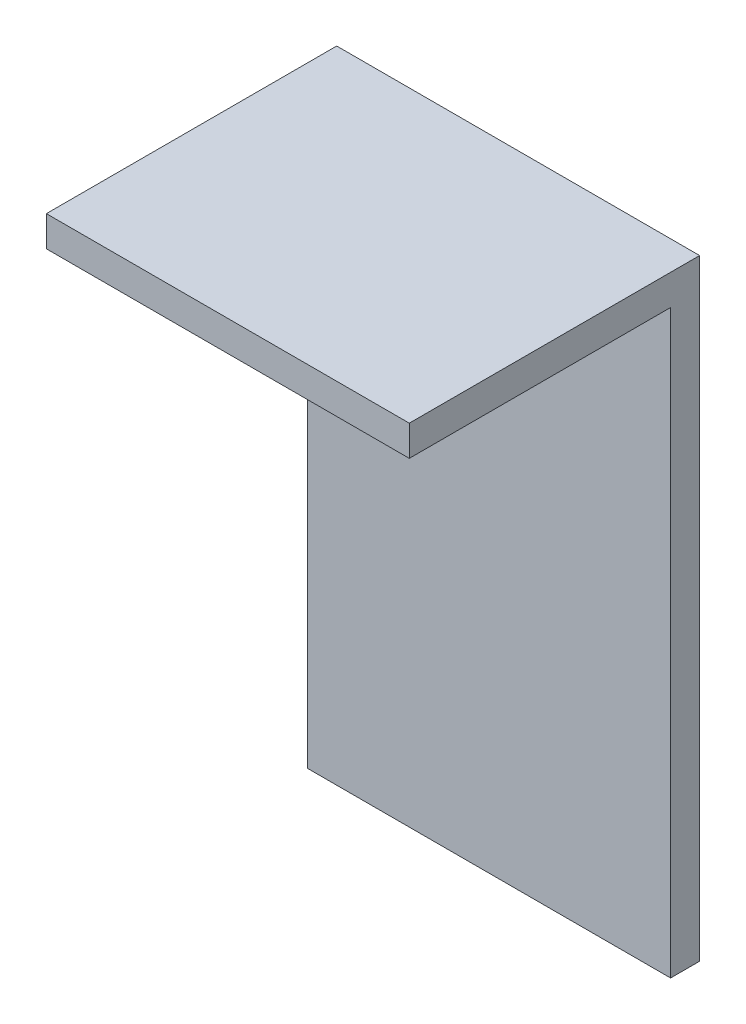
ISO-10303-21;
HEADER;
FILE_DESCRIPTION(('STEP AP214'),'2;1');
FILE_NAME('part.step','',(''),(''),'','','');
FILE_SCHEMA(('AUTOMOTIVE_DESIGN { 1 0 10303 214 1 1 1 1 }'));
ENDSEC;
DATA;
#1=APPLICATION_CONTEXT('core data for automotive mechanical design processes');
#2=APPLICATION_PROTOCOL_DEFINITION('international standard','automotive_design',2000,#1);
#3=PRODUCT_CONTEXT('',#1,'mechanical');
#4=PRODUCT('Part','Part','',(#3));
#5=PRODUCT_RELATED_PRODUCT_CATEGORY('part','',(#4));
#6=PRODUCT_DEFINITION_FORMATION('','',#4);
#7=PRODUCT_DEFINITION_CONTEXT('part definition',#1,'design');
#8=PRODUCT_DEFINITION('design','',#6,#7);
#9=PRODUCT_DEFINITION_SHAPE('','',#8);
#10=(LENGTH_UNIT() NAMED_UNIT(*) SI_UNIT(.MILLI.,.METRE.));
#11=(NAMED_UNIT(*) PLANE_ANGLE_UNIT() SI_UNIT($,.RADIAN.));
#12=(NAMED_UNIT(*) SI_UNIT($,.STERADIAN.) SOLID_ANGLE_UNIT());
#13=UNCERTAINTY_MEASURE_WITH_UNIT(LENGTH_MEASURE(1.E-05),#10,'distance_accuracy_value','');
#14=(GEOMETRIC_REPRESENTATION_CONTEXT(3) GLOBAL_UNCERTAINTY_ASSIGNED_CONTEXT((#13)) GLOBAL_UNIT_ASSIGNED_CONTEXT((#10,
#11,#12)) REPRESENTATION_CONTEXT('',''));
#15=CARTESIAN_POINT('',(0.,0.,0.));
#16=DIRECTION('',(0.,0.,1.));
#17=DIRECTION('',(1.,0.,0.));
#18=AXIS2_PLACEMENT_3D('',#15,#16,#17);
#19=CARTESIAN_POINT('',(-0.27832069959544,1.5105,0.2));
#20=DIRECTION('',(0.,0.,1.));
#21=DIRECTION('',(0.,-1.,0.));
#22=AXIS2_PLACEMENT_3D('',#19,#20,#21);
#23=PLANE('',#22);
#24=DIRECTION('',(1.,0.,0.));
#25=VECTOR('',#24,1.);
#26=CARTESIAN_POINT('',(-0.27832069959544,1.521,0.2));
#27=LINE('',#26,#25);
#28=CARTESIAN_POINT('',(-0.403320699595441,1.521,0.2));
#29=VERTEX_POINT('',#28);
#30=CARTESIAN_POINT('',(-0.153320699595441,1.521,0.2));
#31=VERTEX_POINT('',#30);
#32=EDGE_CURVE('E75',#29,#31,#27,.T.);
#33=ORIENTED_EDGE('',*,*,#32,.F.);
#34=DIRECTION('',(0.,-1.,0.));
#35=VECTOR('',#34,1.);
#36=CARTESIAN_POINT('',(-0.403320699595441,1.36847101449275,0.2));
#37=LINE('',#36,#35);
#38=CARTESIAN_POINT('',(-0.403320699595441,1.5,0.2));
#39=VERTEX_POINT('',#38);
#40=EDGE_CURVE('E97',#29,#39,#37,.T.);
#41=ORIENTED_EDGE('',*,*,#40,.T.);
#42=DIRECTION('',(1.,0.,0.));
#43=VECTOR('',#42,1.);
#44=CARTESIAN_POINT('',(-0.27832069959544,1.5,0.2));
#45=LINE('',#44,#43);
#46=CARTESIAN_POINT('',(-0.153320699595441,1.5,0.2));
#47=VERTEX_POINT('',#46);
#48=EDGE_CURVE('E11',#39,#47,#45,.T.);
#49=ORIENTED_EDGE('',*,*,#48,.T.);
#50=DIRECTION('',(0.,-1.,0.));
#51=VECTOR('',#50,1.);
#52=CARTESIAN_POINT('',(-0.15332069959544,1.36847101449275,0.2));
#53=LINE('',#52,#51);
#54=EDGE_CURVE('E94',#31,#47,#53,.T.);
#55=ORIENTED_EDGE('',*,*,#54,.F.);
#56=EDGE_LOOP('',(#33,#41,#49,#55));
#57=FACE_BOUND('',#56,.T.);
#58=ADVANCED_FACE('F17',(#57),#23,.T.);
#59=CARTESIAN_POINT('',(-0.27832069959544,1.5,0.11));
#60=DIRECTION('',(0.,1.,0.));
#61=DIRECTION('',(1.,0.,0.));
#62=AXIS2_PLACEMENT_3D('',#59,#60,#61);
#63=PLANE('',#62);
#64=DIRECTION('',(0.,0.,-1.));
#65=VECTOR('',#64,1.);
#66=CARTESIAN_POINT('',(-0.403320699595441,1.5,0.0420289855072457));
#67=LINE('',#66,#65);
#68=CARTESIAN_POINT('',(-0.403320699595441,1.5,0.02));
#69=VERTEX_POINT('',#68);
#70=EDGE_CURVE('E128',#39,#69,#67,.T.);
#71=ORIENTED_EDGE('',*,*,#70,.T.);
#72=DIRECTION('',(-1.,0.,0.));
#73=VECTOR('',#72,1.);
#74=CARTESIAN_POINT('',(-0.27832069959544,1.5,0.02));
#75=LINE('',#74,#73);
#76=CARTESIAN_POINT('',(-0.15332069959544,1.5,0.02));
#77=VERTEX_POINT('',#76);
#78=EDGE_CURVE('E27',#77,#69,#75,.T.);
#79=ORIENTED_EDGE('',*,*,#78,.F.);
#80=DIRECTION('',(0.,0.,-1.));
#81=VECTOR('',#80,1.);
#82=CARTESIAN_POINT('',(-0.153320699595441,1.5,0.0420289855072457));
#83=LINE('',#82,#81);
#84=EDGE_CURVE('E100',#47,#77,#83,.T.);
#85=ORIENTED_EDGE('',*,*,#84,.F.);
#86=ORIENTED_EDGE('',*,*,#48,.F.);
#87=EDGE_LOOP('',(#71,#79,#85,#86));
#88=FACE_BOUND('',#87,.T.);
#89=ADVANCED_FACE('F101',(#88),#63,.F.);
#90=CARTESIAN_POINT('',(-0.27832069959544,1.3,0.02));
#91=DIRECTION('',(0.,0.,1.));
#92=DIRECTION('',(0.,-1.,0.));
#93=AXIS2_PLACEMENT_3D('',#90,#91,#92);
#94=PLANE('',#93);
#95=DIRECTION('',(0.,-1.,0.));
#96=VECTOR('',#95,1.);
#97=CARTESIAN_POINT('',(-0.403320699595441,1.36847101449275,0.02));
#98=LINE('',#97,#96);
#99=CARTESIAN_POINT('',(-0.40332069959544,1.1,0.02));
#100=VERTEX_POINT('',#99);
#101=EDGE_CURVE('E131',#69,#100,#98,.T.);
#102=ORIENTED_EDGE('',*,*,#101,.T.);
#103=DIRECTION('',(1.,0.,0.));
#104=VECTOR('',#103,1.);
#105=CARTESIAN_POINT('',(-0.27832069959544,1.1,0.02));
#106=LINE('',#105,#104);
#107=CARTESIAN_POINT('',(-0.153320699595439,1.1,0.02));
#108=VERTEX_POINT('',#107);
#109=EDGE_CURVE('E41',#100,#108,#106,.T.);
#110=ORIENTED_EDGE('',*,*,#109,.T.);
#111=DIRECTION('',(0.,-1.,0.));
#112=VECTOR('',#111,1.);
#113=CARTESIAN_POINT('',(-0.15332069959544,1.36847101449275,0.02));
#114=LINE('',#113,#112);
#115=EDGE_CURVE('E105',#77,#108,#114,.T.);
#116=ORIENTED_EDGE('',*,*,#115,.F.);
#117=ORIENTED_EDGE('',*,*,#78,.T.);
#118=EDGE_LOOP('',(#102,#110,#116,#117));
#119=FACE_BOUND('',#118,.T.);
#120=ADVANCED_FACE('F19',(#119),#94,.T.);
#121=CARTESIAN_POINT('',(-0.27832069959544,1.1,0.01));
#122=DIRECTION('',(0.,1.,0.));
#123=DIRECTION('',(1.,0.,0.));
#124=AXIS2_PLACEMENT_3D('',#121,#122,#123);
#125=PLANE('',#124);
#126=DIRECTION('',(0.,0.,-1.));
#127=VECTOR('',#126,1.);
#128=CARTESIAN_POINT('',(-0.153320699595439,1.1,0.0420289855072457));
#129=LINE('',#128,#127);
#130=CARTESIAN_POINT('',(-0.153320699595439,1.1,0.));
#131=VERTEX_POINT('',#130);
#132=EDGE_CURVE('E118',#108,#131,#129,.T.);
#133=ORIENTED_EDGE('',*,*,#132,.F.);
#134=ORIENTED_EDGE('',*,*,#109,.F.);
#135=DIRECTION('',(0.,0.,-1.));
#136=VECTOR('',#135,1.);
#137=CARTESIAN_POINT('',(-0.40332069959544,1.1,0.0420289855072457));
#138=LINE('',#137,#136);
#139=CARTESIAN_POINT('',(-0.40332069959544,1.1,0.));
#140=VERTEX_POINT('',#139);
#141=EDGE_CURVE('E123',#100,#140,#138,.T.);
#142=ORIENTED_EDGE('',*,*,#141,.T.);
#143=DIRECTION('',(1.,0.,0.));
#144=VECTOR('',#143,1.);
#145=CARTESIAN_POINT('',(-0.27832069959544,1.1,0.));
#146=LINE('',#145,#144);
#147=EDGE_CURVE('E138',#140,#131,#146,.T.);
#148=ORIENTED_EDGE('',*,*,#147,.T.);
#149=EDGE_LOOP('',(#133,#134,#142,#148));
#150=FACE_BOUND('',#149,.T.);
#151=ADVANCED_FACE('F172',(#150),#125,.F.);
#152=CARTESIAN_POINT('',(-0.15332069959544,1.36847101449275,0.0420289855072457));
#153=DIRECTION('',(1.,0.,0.));
#154=DIRECTION('',(0.,1.,0.));
#155=AXIS2_PLACEMENT_3D('',#152,#153,#154);
#156=PLANE('',#155);
#157=DIRECTION('',(0.,0.,-1.));
#158=VECTOR('',#157,1.);
#159=CARTESIAN_POINT('',(-0.153320699595441,1.521,0.0999999999999988));
#160=LINE('',#159,#158);
#161=CARTESIAN_POINT('',(-0.153320699595441,1.521,0.));
#162=VERTEX_POINT('',#161);
#163=EDGE_CURVE('E109',#31,#162,#160,.T.);
#164=ORIENTED_EDGE('',*,*,#163,.F.);
#165=ORIENTED_EDGE('',*,*,#54,.T.);
#166=ORIENTED_EDGE('',*,*,#84,.T.);
#167=ORIENTED_EDGE('',*,*,#115,.T.);
#168=ORIENTED_EDGE('',*,*,#132,.T.);
#169=DIRECTION('',(0.,1.,0.));
#170=VECTOR('',#169,1.);
#171=CARTESIAN_POINT('',(-0.153320699595439,1.3105,0.));
#172=LINE('',#171,#170);
#173=EDGE_CURVE('E146',#131,#162,#172,.T.);
#174=ORIENTED_EDGE('',*,*,#173,.T.);
#175=EDGE_LOOP('',(#164,#165,#166,#167,#168,#174));
#176=FACE_BOUND('',#175,.T.);
#177=ADVANCED_FACE('F107',(#176),#156,.T.);
#178=CARTESIAN_POINT('',(-0.27832069959544,1.521,0.0999999999999988));
#179=DIRECTION('',(0.,1.,0.));
#180=DIRECTION('',(1.,0.,0.));
#181=AXIS2_PLACEMENT_3D('',#178,#179,#180);
#182=PLANE('',#181);
#183=ORIENTED_EDGE('',*,*,#32,.T.);
#184=ORIENTED_EDGE('',*,*,#163,.T.);
#185=DIRECTION('',(-1.,0.,0.));
#186=VECTOR('',#185,1.);
#187=CARTESIAN_POINT('',(-0.27832069959544,1.521,0.));
#188=LINE('',#187,#186);
#189=CARTESIAN_POINT('',(-0.403320699595441,1.521,0.));
#190=VERTEX_POINT('',#189);
#191=EDGE_CURVE('E153',#162,#190,#188,.T.);
#192=ORIENTED_EDGE('',*,*,#191,.T.);
#193=DIRECTION('',(0.,0.,1.));
#194=VECTOR('',#193,1.);
#195=CARTESIAN_POINT('',(-0.403320699595441,1.521,0.0420289855072457));
#196=LINE('',#195,#194);
#197=EDGE_CURVE('E127',#190,#29,#196,.T.);
#198=ORIENTED_EDGE('',*,*,#197,.T.);
#199=EDGE_LOOP('',(#183,#184,#192,#198));
#200=FACE_BOUND('',#199,.T.);
#201=ADVANCED_FACE('F160',(#200),#182,.T.);
#202=CARTESIAN_POINT('',(-0.403320699595441,1.36847101449275,0.0420289855072457));
#203=DIRECTION('',(1.,0.,0.));
#204=DIRECTION('',(0.,1.,0.));
#205=AXIS2_PLACEMENT_3D('',#202,#203,#204);
#206=PLANE('',#205);
#207=ORIENTED_EDGE('',*,*,#101,.F.);
#208=ORIENTED_EDGE('',*,*,#70,.F.);
#209=ORIENTED_EDGE('',*,*,#40,.F.);
#210=ORIENTED_EDGE('',*,*,#197,.F.);
#211=DIRECTION('',(0.,-1.,0.));
#212=VECTOR('',#211,1.);
#213=CARTESIAN_POINT('',(-0.403320699595441,1.3105,0.));
#214=LINE('',#213,#212);
#215=EDGE_CURVE('E134',#190,#140,#214,.T.);
#216=ORIENTED_EDGE('',*,*,#215,.T.);
#217=ORIENTED_EDGE('',*,*,#141,.F.);
#218=EDGE_LOOP('',(#207,#208,#209,#210,#216,#217));
#219=FACE_BOUND('',#218,.T.);
#220=ADVANCED_FACE('F170',(#219),#206,.F.);
#221=CARTESIAN_POINT('',(-0.27832069959544,1.3105,0.));
#222=DIRECTION('',(0.,0.,1.));
#223=DIRECTION('',(0.,-1.,0.));
#224=AXIS2_PLACEMENT_3D('',#221,#222,#223);
#225=PLANE('',#224);
#226=ORIENTED_EDGE('',*,*,#191,.F.);
#227=ORIENTED_EDGE('',*,*,#173,.F.);
#228=ORIENTED_EDGE('',*,*,#147,.F.);
#229=ORIENTED_EDGE('',*,*,#215,.F.);
#230=EDGE_LOOP('',(#226,#227,#228,#229));
#231=FACE_BOUND('',#230,.T.);
#232=ADVANCED_FACE('F165',(#231),#225,.F.);
#233=CLOSED_SHELL('',(#58,#89,#120,#151,#177,#201,#220,#232));
#234=MANIFOLD_SOLID_BREP('B1',#233);
#235=ADVANCED_BREP_SHAPE_REPRESENTATION('',(#18,#234),#14);
#236=SHAPE_DEFINITION_REPRESENTATION(#9,#235);
ENDSEC;
END-ISO-10303-21;
